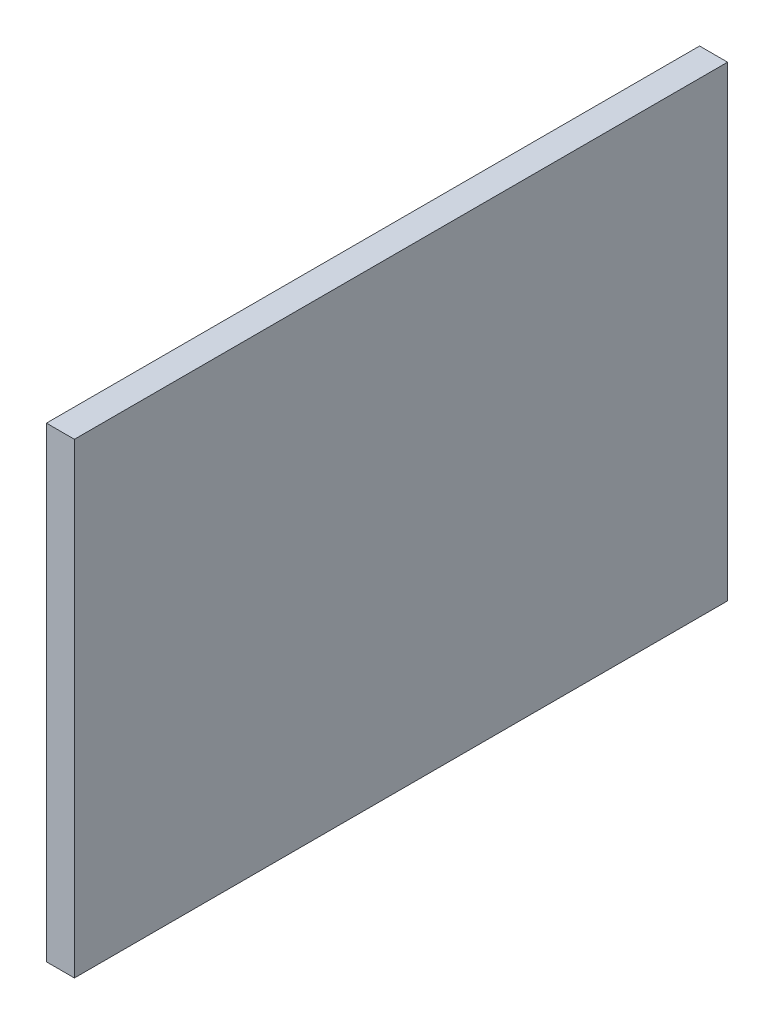
ISO-10303-21;
HEADER;
FILE_DESCRIPTION(('STEP AP214'),'2;1');
FILE_NAME('part.step','',(''),(''),'','','');
FILE_SCHEMA(('AUTOMOTIVE_DESIGN { 1 0 10303 214 1 1 1 1 }'));
ENDSEC;
DATA;
#1=APPLICATION_CONTEXT('core data for automotive mechanical design processes');
#2=APPLICATION_PROTOCOL_DEFINITION('international standard','automotive_design',2000,#1);
#3=PRODUCT_CONTEXT('',#1,'mechanical');
#4=PRODUCT('Part','Part','',(#3));
#5=PRODUCT_RELATED_PRODUCT_CATEGORY('part','',(#4));
#6=PRODUCT_DEFINITION_FORMATION('','',#4);
#7=PRODUCT_DEFINITION_CONTEXT('part definition',#1,'design');
#8=PRODUCT_DEFINITION('design','',#6,#7);
#9=PRODUCT_DEFINITION_SHAPE('','',#8);
#10=(LENGTH_UNIT() NAMED_UNIT(*) SI_UNIT(.MILLI.,.METRE.));
#11=(NAMED_UNIT(*) PLANE_ANGLE_UNIT() SI_UNIT($,.RADIAN.));
#12=(NAMED_UNIT(*) SI_UNIT($,.STERADIAN.) SOLID_ANGLE_UNIT());
#13=UNCERTAINTY_MEASURE_WITH_UNIT(LENGTH_MEASURE(1.E-05),#10,'distance_accuracy_value','');
#14=(GEOMETRIC_REPRESENTATION_CONTEXT(3) GLOBAL_UNCERTAINTY_ASSIGNED_CONTEXT((#13)) GLOBAL_UNIT_ASSIGNED_CONTEXT((#10,
#11,#12)) REPRESENTATION_CONTEXT('',''));
#15=CARTESIAN_POINT('',(0.,0.,0.));
#16=DIRECTION('',(0.,0.,1.));
#17=DIRECTION('',(1.,0.,0.));
#18=AXIS2_PLACEMENT_3D('',#15,#16,#17);
#19=CARTESIAN_POINT('',(3.,32.9884455639165,51.1786860954591));
#20=DIRECTION('',(0.,0.,-1.));
#21=DIRECTION('',(-1.,0.,0.));
#22=AXIS2_PLACEMENT_3D('',#19,#20,#21);
#23=PLANE('',#22);
#24=DIRECTION('',(0.,-1.,0.));
#25=VECTOR('',#24,1.);
#26=CARTESIAN_POINT('',(0.,32.9884455639165,51.1786860954591));
#27=LINE('',#26,#25);
#28=CARTESIAN_POINT('',(0.,32.9884455639165,51.1786860954591));
#29=VERTEX_POINT('',#28);
#30=CARTESIAN_POINT('',(0.,-17.0115544360835,51.1786860954591));
#31=VERTEX_POINT('',#30);
#32=EDGE_CURVE('E96',#29,#31,#27,.T.);
#33=ORIENTED_EDGE('',*,*,#32,.T.);
#34=DIRECTION('',(-1.,0.,0.));
#35=VECTOR('',#34,1.);
#36=CARTESIAN_POINT('',(3.,-17.0115544360835,51.1786860954591));
#37=LINE('',#36,#35);
#38=CARTESIAN_POINT('',(3.,-17.0115544360835,51.1786860954591));
#39=VERTEX_POINT('',#38);
#40=EDGE_CURVE('E11',#39,#31,#37,.T.);
#41=ORIENTED_EDGE('',*,*,#40,.F.);
#42=DIRECTION('',(0.,-1.,0.));
#43=VECTOR('',#42,1.);
#44=CARTESIAN_POINT('',(3.,32.9884455639165,51.1786860954591));
#45=LINE('',#44,#43);
#46=CARTESIAN_POINT('',(3.,32.9884455639165,51.1786860954591));
#47=VERTEX_POINT('',#46);
#48=EDGE_CURVE('E84',#47,#39,#45,.T.);
#49=ORIENTED_EDGE('',*,*,#48,.F.);
#50=DIRECTION('',(-1.,0.,0.));
#51=VECTOR('',#50,1.);
#52=CARTESIAN_POINT('',(3.,32.9884455639165,51.1786860954591));
#53=LINE('',#52,#51);
#54=EDGE_CURVE('E92',#47,#29,#53,.T.);
#55=ORIENTED_EDGE('',*,*,#54,.T.);
#56=EDGE_LOOP('',(#33,#41,#49,#55));
#57=FACE_BOUND('',#56,.T.);
#58=ADVANCED_FACE('F33',(#57),#23,.F.);
#59=CARTESIAN_POINT('',(3.,-17.0115544360835,51.1786860954591));
#60=DIRECTION('',(0.,1.,0.));
#61=DIRECTION('',(0.,0.,1.));
#62=AXIS2_PLACEMENT_3D('',#59,#60,#61);
#63=PLANE('',#62);
#64=DIRECTION('',(0.,0.,-1.));
#65=VECTOR('',#64,1.);
#66=CARTESIAN_POINT('',(0.,-17.0115544360835,51.1786860954591));
#67=LINE('',#66,#65);
#68=CARTESIAN_POINT('',(0.,-17.0115544360835,-18.8213139045409));
#69=VERTEX_POINT('',#68);
#70=EDGE_CURVE('E88',#31,#69,#67,.T.);
#71=ORIENTED_EDGE('',*,*,#70,.T.);
#72=DIRECTION('',(-1.,0.,0.));
#73=VECTOR('',#72,1.);
#74=CARTESIAN_POINT('',(3.,-17.0115544360835,-18.8213139045409));
#75=LINE('',#74,#73);
#76=CARTESIAN_POINT('',(3.,-17.0115544360835,-18.8213139045409));
#77=VERTEX_POINT('',#76);
#78=EDGE_CURVE('E41',#77,#69,#75,.T.);
#79=ORIENTED_EDGE('',*,*,#78,.F.);
#80=DIRECTION('',(0.,0.,-1.));
#81=VECTOR('',#80,1.);
#82=CARTESIAN_POINT('',(3.,-17.0115544360835,51.1786860954591));
#83=LINE('',#82,#81);
#84=EDGE_CURVE('E79',#39,#77,#83,.T.);
#85=ORIENTED_EDGE('',*,*,#84,.F.);
#86=ORIENTED_EDGE('',*,*,#40,.T.);
#87=EDGE_LOOP('',(#71,#79,#85,#86));
#88=FACE_BOUND('',#87,.T.);
#89=ADVANCED_FACE('F87',(#88),#63,.F.);
#90=CARTESIAN_POINT('',(3.,32.9884455639165,-18.8213139045409));
#91=DIRECTION('',(0.,0.,1.));
#92=DIRECTION('',(1.,0.,0.));
#93=AXIS2_PLACEMENT_3D('',#90,#91,#92);
#94=PLANE('',#93);
#95=DIRECTION('',(0.,1.,0.));
#96=VECTOR('',#95,1.);
#97=CARTESIAN_POINT('',(0.,32.9884455639165,-18.8213139045409));
#98=LINE('',#97,#96);
#99=CARTESIAN_POINT('',(0.,32.9884455639165,-18.8213139045409));
#100=VERTEX_POINT('',#99);
#101=EDGE_CURVE('E66',#69,#100,#98,.T.);
#102=ORIENTED_EDGE('',*,*,#101,.T.);
#103=DIRECTION('',(-1.,0.,0.));
#104=VECTOR('',#103,1.);
#105=CARTESIAN_POINT('',(3.,32.9884455639165,-18.8213139045409));
#106=LINE('',#105,#104);
#107=CARTESIAN_POINT('',(3.,32.9884455639165,-18.8213139045409));
#108=VERTEX_POINT('',#107);
#109=EDGE_CURVE('E89',#108,#100,#106,.T.);
#110=ORIENTED_EDGE('',*,*,#109,.F.);
#111=DIRECTION('',(0.,1.,0.));
#112=VECTOR('',#111,1.);
#113=CARTESIAN_POINT('',(3.,32.9884455639165,-18.8213139045409));
#114=LINE('',#113,#112);
#115=EDGE_CURVE('E82',#77,#108,#114,.T.);
#116=ORIENTED_EDGE('',*,*,#115,.F.);
#117=ORIENTED_EDGE('',*,*,#78,.T.);
#118=EDGE_LOOP('',(#102,#110,#116,#117));
#119=FACE_BOUND('',#118,.T.);
#120=ADVANCED_FACE('F90',(#119),#94,.F.);
#121=CARTESIAN_POINT('',(3.,32.9884455639165,51.1786860954591));
#122=DIRECTION('',(0.,-1.,0.));
#123=DIRECTION('',(0.,0.,-1.));
#124=AXIS2_PLACEMENT_3D('',#121,#122,#123);
#125=PLANE('',#124);
#126=DIRECTION('',(0.,0.,1.));
#127=VECTOR('',#126,1.);
#128=CARTESIAN_POINT('',(0.,32.9884455639165,51.1786860954591));
#129=LINE('',#128,#127);
#130=EDGE_CURVE('E72',#100,#29,#129,.T.);
#131=ORIENTED_EDGE('',*,*,#130,.T.);
#132=ORIENTED_EDGE('',*,*,#54,.F.);
#133=DIRECTION('',(0.,0.,1.));
#134=VECTOR('',#133,1.);
#135=CARTESIAN_POINT('',(3.,32.9884455639165,51.1786860954591));
#136=LINE('',#135,#134);
#137=EDGE_CURVE('E49',#108,#47,#136,.T.);
#138=ORIENTED_EDGE('',*,*,#137,.F.);
#139=ORIENTED_EDGE('',*,*,#109,.T.);
#140=EDGE_LOOP('',(#131,#132,#138,#139));
#141=FACE_BOUND('',#140,.T.);
#142=ADVANCED_FACE('F103',(#141),#125,.F.);
#143=CARTESIAN_POINT('',(3.,0.,0.));
#144=DIRECTION('',(1.,0.,0.));
#145=DIRECTION('',(0.,0.,-1.));
#146=AXIS2_PLACEMENT_3D('',#143,#144,#145);
#147=PLANE('',#146);
#148=ORIENTED_EDGE('',*,*,#48,.T.);
#149=ORIENTED_EDGE('',*,*,#84,.T.);
#150=ORIENTED_EDGE('',*,*,#115,.T.);
#151=ORIENTED_EDGE('',*,*,#137,.T.);
#152=EDGE_LOOP('',(#148,#149,#150,#151));
#153=FACE_BOUND('',#152,.T.);
#154=ADVANCED_FACE('F80',(#153),#147,.T.);
#155=CARTESIAN_POINT('',(0.,0.,0.));
#156=DIRECTION('',(1.,0.,0.));
#157=DIRECTION('',(0.,0.,-1.));
#158=AXIS2_PLACEMENT_3D('',#155,#156,#157);
#159=PLANE('',#158);
#160=ORIENTED_EDGE('',*,*,#32,.F.);
#161=ORIENTED_EDGE('',*,*,#130,.F.);
#162=ORIENTED_EDGE('',*,*,#101,.F.);
#163=ORIENTED_EDGE('',*,*,#70,.F.);
#164=EDGE_LOOP('',(#160,#161,#162,#163));
#165=FACE_BOUND('',#164,.T.);
#166=ADVANCED_FACE('F106',(#165),#159,.F.);
#167=CLOSED_SHELL('',(#58,#89,#120,#142,#154,#166));
#168=MANIFOLD_SOLID_BREP('B2',#167);
#169=ADVANCED_BREP_SHAPE_REPRESENTATION('',(#18,#168),#14);
#170=SHAPE_DEFINITION_REPRESENTATION(#9,#169);
ENDSEC;
END-ISO-10303-21;
